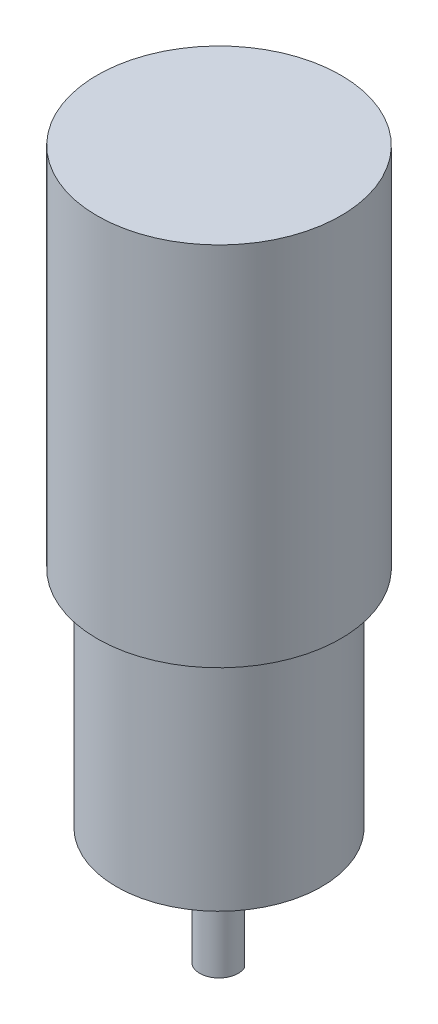
ISO-10303-21;
HEADER;
FILE_DESCRIPTION(('STEP AP214'),'2;1');
FILE_NAME('part.step','',(''),(''),'','','');
FILE_SCHEMA(('AUTOMOTIVE_DESIGN { 1 0 10303 214 1 1 1 1 }'));
ENDSEC;
DATA;
#1=APPLICATION_CONTEXT('core data for automotive mechanical design processes');
#2=APPLICATION_PROTOCOL_DEFINITION('international standard','automotive_design',2000,#1);
#3=PRODUCT_CONTEXT('',#1,'mechanical');
#4=PRODUCT('Part','Part','',(#3));
#5=PRODUCT_RELATED_PRODUCT_CATEGORY('part','',(#4));
#6=PRODUCT_DEFINITION_FORMATION('','',#4);
#7=PRODUCT_DEFINITION_CONTEXT('part definition',#1,'design');
#8=PRODUCT_DEFINITION('design','',#6,#7);
#9=PRODUCT_DEFINITION_SHAPE('','',#8);
#10=(LENGTH_UNIT() NAMED_UNIT(*) SI_UNIT(.MILLI.,.METRE.));
#11=(NAMED_UNIT(*) PLANE_ANGLE_UNIT() SI_UNIT($,.RADIAN.));
#12=(NAMED_UNIT(*) SI_UNIT($,.STERADIAN.) SOLID_ANGLE_UNIT());
#13=UNCERTAINTY_MEASURE_WITH_UNIT(LENGTH_MEASURE(1.E-05),#10,'distance_accuracy_value','');
#14=(GEOMETRIC_REPRESENTATION_CONTEXT(3) GLOBAL_UNCERTAINTY_ASSIGNED_CONTEXT((#13)) GLOBAL_UNIT_ASSIGNED_CONTEXT((#10,
#11,#12)) REPRESENTATION_CONTEXT('',''));
#15=CARTESIAN_POINT('',(0.,0.,0.));
#16=DIRECTION('',(0.,0.,1.));
#17=DIRECTION('',(1.,0.,0.));
#18=AXIS2_PLACEMENT_3D('',#15,#16,#17);
#19=CARTESIAN_POINT('',(0.,12.,-1.19895788082818));
#20=DIRECTION('',(0.,0.,-1.));
#21=DIRECTION('',(-1.,0.,0.));
#22=AXIS2_PLACEMENT_3D('',#19,#20,#21);
#23=PLANE('',#22);
#24=DIRECTION('',(1.,0.,0.));
#25=VECTOR('',#24,1.);
#26=CARTESIAN_POINT('',(0.,0.,-1.19895788082818));
#27=LINE('',#26,#25);
#28=CARTESIAN_POINT('',(-2.75,0.,-1.19895788082818));
#29=VERTEX_POINT('',#28);
#30=CARTESIAN_POINT('',(2.75,0.,-1.19895788082818));
#31=VERTEX_POINT('',#30);
#32=EDGE_CURVE('E141',#29,#31,#27,.T.);
#33=ORIENTED_EDGE('',*,*,#32,.F.);
#34=DIRECTION('',(0.,-1.,0.));
#35=VECTOR('',#34,1.);
#36=CARTESIAN_POINT('',(-2.75,12.,-1.19895788082818));
#37=LINE('',#36,#35);
#38=CARTESIAN_POINT('',(-2.75,12.,-1.19895788082818));
#39=VERTEX_POINT('',#38);
#40=EDGE_CURVE('E11',#39,#29,#37,.T.);
#41=ORIENTED_EDGE('',*,*,#40,.F.);
#42=DIRECTION('',(1.,0.,0.));
#43=VECTOR('',#42,1.);
#44=CARTESIAN_POINT('',(0.,12.,-1.19895788082818));
#45=LINE('',#44,#43);
#46=CARTESIAN_POINT('',(2.75,12.,-1.19895788082818));
#47=VERTEX_POINT('',#46);
#48=EDGE_CURVE('E66',#39,#47,#45,.T.);
#49=ORIENTED_EDGE('',*,*,#48,.T.);
#50=DIRECTION('',(0.,-1.,0.));
#51=VECTOR('',#50,1.);
#52=CARTESIAN_POINT('',(2.75,12.,-1.19895788082818));
#53=LINE('',#52,#51);
#54=EDGE_CURVE('E47',#47,#31,#53,.T.);
#55=ORIENTED_EDGE('',*,*,#54,.T.);
#56=EDGE_LOOP('',(#33,#41,#49,#55));
#57=FACE_BOUND('',#56,.T.);
#58=ADVANCED_FACE('F39',(#57),#23,.T.);
#59=CARTESIAN_POINT('',(0.,12.,0.));
#60=DIRECTION('',(0.,-1.,0.));
#61=DIRECTION('',(0.,0.,-1.));
#62=AXIS2_PLACEMENT_3D('',#59,#60,#61);
#63=CYLINDRICAL_SURFACE('',#62,3.);
#64=CARTESIAN_POINT('',(0.,0.,0.));
#65=DIRECTION('',(0.,1.,0.));
#66=DIRECTION('',(0.,0.,1.));
#67=AXIS2_PLACEMENT_3D('',#64,#65,#66);
#68=CIRCLE('',#67,3.);
#69=EDGE_CURVE('E144',#29,#31,#68,.T.);
#70=ORIENTED_EDGE('',*,*,#69,.T.);
#71=ORIENTED_EDGE('',*,*,#54,.F.);
#72=CARTESIAN_POINT('',(0.,12.,0.));
#73=DIRECTION('',(0.,1.,0.));
#74=DIRECTION('',(0.,0.,1.));
#75=AXIS2_PLACEMENT_3D('',#72,#73,#74);
#76=CIRCLE('',#75,3.);
#77=EDGE_CURVE('E53',#47,#39,#76,.T.);
#78=ORIENTED_EDGE('',*,*,#77,.T.);
#79=ORIENTED_EDGE('',*,*,#40,.T.);
#80=EDGE_LOOP('',(#70,#71,#78,#79));
#81=FACE_BOUND('',#80,.T.);
#82=CARTESIAN_POINT('',(0.,15.2,0.));
#83=DIRECTION('',(0.,1.,0.));
#84=DIRECTION('',(0.,0.,1.));
#85=AXIS2_PLACEMENT_3D('',#82,#83,#84);
#86=CIRCLE('',#85,3.);
#87=CARTESIAN_POINT('',(0.,15.2,3.));
#88=VERTEX_POINT('',#87);
#89=EDGE_CURVE('E138',#88,#88,#86,.T.);
#90=ORIENTED_EDGE('',*,*,#89,.F.);
#91=EDGE_LOOP('',(#90));
#92=FACE_BOUND('',#91,.T.);
#93=ADVANCED_FACE('F149',(#81,#92),#63,.T.);
#94=CARTESIAN_POINT('',(0.,0.,0.));
#95=DIRECTION('',(0.,1.,0.));
#96=DIRECTION('',(0.,0.,1.));
#97=AXIS2_PLACEMENT_3D('',#94,#95,#96);
#98=PLANE('',#97);
#99=ORIENTED_EDGE('',*,*,#32,.T.);
#100=ORIENTED_EDGE('',*,*,#69,.F.);
#101=EDGE_LOOP('',(#99,#100));
#102=FACE_BOUND('',#101,.T.);
#103=ADVANCED_FACE('F152',(#102),#98,.F.);
#104=CARTESIAN_POINT('',(0.,12.,0.));
#105=DIRECTION('',(0.,1.,0.));
#106=DIRECTION('',(0.,0.,1.));
#107=AXIS2_PLACEMENT_3D('',#104,#105,#106);
#108=PLANE('',#107);
#109=ORIENTED_EDGE('',*,*,#48,.F.);
#110=ORIENTED_EDGE('',*,*,#77,.F.);
#111=EDGE_LOOP('',(#109,#110));
#112=FACE_BOUND('',#111,.T.);
#113=ADVANCED_FACE('F154',(#112),#108,.F.);
#114=CARTESIAN_POINT('',(0.,18.2,0.));
#115=DIRECTION('',(0.,-1.,0.));
#116=DIRECTION('',(0.,0.,-1.));
#117=AXIS2_PLACEMENT_3D('',#114,#115,#116);
#118=CYLINDRICAL_SURFACE('',#117,10.);
#119=CARTESIAN_POINT('',(0.,15.2,0.));
#120=DIRECTION('',(0.,1.,0.));
#121=DIRECTION('',(0.,0.,1.));
#122=AXIS2_PLACEMENT_3D('',#119,#120,#121);
#123=CIRCLE('',#122,10.);
#124=CARTESIAN_POINT('',(9.,15.2,-4.35889894354067));
#125=VERTEX_POINT('',#124);
#126=CARTESIAN_POINT('',(-9.,15.2,-4.35889894354068));
#127=VERTEX_POINT('',#126);
#128=EDGE_CURVE('E125',#125,#127,#123,.T.);
#129=ORIENTED_EDGE('',*,*,#128,.T.);
#130=DIRECTION('',(0.,-1.,0.));
#131=VECTOR('',#130,1.);
#132=CARTESIAN_POINT('',(-9.,18.2,-4.35889894354068));
#133=LINE('',#132,#131);
#134=CARTESIAN_POINT('',(-9.,18.2,-4.35889894354068));
#135=VERTEX_POINT('',#134);
#136=EDGE_CURVE('E111',#135,#127,#133,.T.);
#137=ORIENTED_EDGE('',*,*,#136,.F.);
#138=CARTESIAN_POINT('',(0.,18.2,0.));
#139=DIRECTION('',(0.,1.,0.));
#140=DIRECTION('',(0.,0.,1.));
#141=AXIS2_PLACEMENT_3D('',#138,#139,#140);
#142=CIRCLE('',#141,10.);
#143=CARTESIAN_POINT('',(9.,18.2,-4.35889894354067));
#144=VERTEX_POINT('',#143);
#145=EDGE_CURVE('E106',#144,#135,#142,.T.);
#146=ORIENTED_EDGE('',*,*,#145,.F.);
#147=DIRECTION('',(0.,-1.,0.));
#148=VECTOR('',#147,1.);
#149=CARTESIAN_POINT('',(9.,18.2,-4.35889894354067));
#150=LINE('',#149,#148);
#151=EDGE_CURVE('E109',#144,#125,#150,.T.);
#152=ORIENTED_EDGE('',*,*,#151,.T.);
#153=EDGE_LOOP('',(#129,#137,#146,#152));
#154=FACE_BOUND('',#153,.T.);
#155=ADVANCED_FACE('F108',(#154),#118,.T.);
#156=CARTESIAN_POINT('',(-9.,18.2,-4.35889894354068));
#157=DIRECTION('',(1.,0.,0.));
#158=DIRECTION('',(0.,0.,-1.));
#159=AXIS2_PLACEMENT_3D('',#156,#157,#158);
#160=PLANE('',#159);
#161=DIRECTION('',(0.,0.,1.));
#162=VECTOR('',#161,1.);
#163=CARTESIAN_POINT('',(-9.,15.2,-4.35889894354068));
#164=LINE('',#163,#162);
#165=CARTESIAN_POINT('',(-9.,15.2,4.35889894354068));
#166=VERTEX_POINT('',#165);
#167=EDGE_CURVE('E127',#127,#166,#164,.T.);
#168=ORIENTED_EDGE('',*,*,#167,.T.);
#169=DIRECTION('',(0.,-1.,0.));
#170=VECTOR('',#169,1.);
#171=CARTESIAN_POINT('',(-9.,18.2,4.35889894354068));
#172=LINE('',#171,#170);
#173=CARTESIAN_POINT('',(-9.,18.2,4.35889894354068));
#174=VERTEX_POINT('',#173);
#175=EDGE_CURVE('E134',#174,#166,#172,.T.);
#176=ORIENTED_EDGE('',*,*,#175,.F.);
#177=DIRECTION('',(0.,0.,1.));
#178=VECTOR('',#177,1.);
#179=CARTESIAN_POINT('',(-9.,18.2,-4.35889894354068));
#180=LINE('',#179,#178);
#181=EDGE_CURVE('E100',#135,#174,#180,.T.);
#182=ORIENTED_EDGE('',*,*,#181,.F.);
#183=ORIENTED_EDGE('',*,*,#136,.T.);
#184=EDGE_LOOP('',(#168,#176,#182,#183));
#185=FACE_BOUND('',#184,.T.);
#186=ADVANCED_FACE('F193',(#185),#160,.F.);
#187=CARTESIAN_POINT('',(0.,18.2,0.));
#188=DIRECTION('',(0.,-1.,0.));
#189=DIRECTION('',(0.,0.,-1.));
#190=AXIS2_PLACEMENT_3D('',#187,#188,#189);
#191=CYLINDRICAL_SURFACE('',#190,10.);
#192=CARTESIAN_POINT('',(0.,15.2,0.));
#193=DIRECTION('',(0.,1.,0.));
#194=DIRECTION('',(0.,0.,1.));
#195=AXIS2_PLACEMENT_3D('',#192,#193,#194);
#196=CIRCLE('',#195,10.);
#197=CARTESIAN_POINT('',(9.,15.2,4.35889894354068));
#198=VERTEX_POINT('',#197);
#199=EDGE_CURVE('E130',#166,#198,#196,.T.);
#200=ORIENTED_EDGE('',*,*,#199,.T.);
#201=DIRECTION('',(0.,-1.,0.));
#202=VECTOR('',#201,1.);
#203=CARTESIAN_POINT('',(9.,18.2,4.35889894354068));
#204=LINE('',#203,#202);
#205=CARTESIAN_POINT('',(9.,18.2,4.35889894354068));
#206=VERTEX_POINT('',#205);
#207=EDGE_CURVE('E74',#206,#198,#204,.T.);
#208=ORIENTED_EDGE('',*,*,#207,.F.);
#209=CARTESIAN_POINT('',(0.,18.2,0.));
#210=DIRECTION('',(0.,1.,0.));
#211=DIRECTION('',(0.,0.,1.));
#212=AXIS2_PLACEMENT_3D('',#209,#210,#211);
#213=CIRCLE('',#212,10.);
#214=EDGE_CURVE('E120',#174,#206,#213,.T.);
#215=ORIENTED_EDGE('',*,*,#214,.F.);
#216=ORIENTED_EDGE('',*,*,#175,.T.);
#217=EDGE_LOOP('',(#200,#208,#215,#216));
#218=FACE_BOUND('',#217,.T.);
#219=ADVANCED_FACE('F201',(#218),#191,.T.);
#220=CARTESIAN_POINT('',(9.,18.2,-4.35889894354067));
#221=DIRECTION('',(-1.,0.,0.));
#222=DIRECTION('',(0.,0.,1.));
#223=AXIS2_PLACEMENT_3D('',#220,#221,#222);
#224=PLANE('',#223);
#225=DIRECTION('',(0.,0.,-1.));
#226=VECTOR('',#225,1.);
#227=CARTESIAN_POINT('',(9.,15.2,-4.35889894354067));
#228=LINE('',#227,#226);
#229=EDGE_CURVE('E94',#198,#125,#228,.T.);
#230=ORIENTED_EDGE('',*,*,#229,.T.);
#231=ORIENTED_EDGE('',*,*,#151,.F.);
#232=DIRECTION('',(0.,0.,-1.));
#233=VECTOR('',#232,1.);
#234=CARTESIAN_POINT('',(9.,18.2,-4.35889894354067));
#235=LINE('',#234,#233);
#236=EDGE_CURVE('E116',#206,#144,#235,.T.);
#237=ORIENTED_EDGE('',*,*,#236,.F.);
#238=ORIENTED_EDGE('',*,*,#207,.T.);
#239=EDGE_LOOP('',(#230,#231,#237,#238));
#240=FACE_BOUND('',#239,.T.);
#241=ADVANCED_FACE('F115',(#240),#224,.F.);
#242=CARTESIAN_POINT('',(0.,15.2,0.));
#243=DIRECTION('',(0.,1.,0.));
#244=DIRECTION('',(0.,0.,1.));
#245=AXIS2_PLACEMENT_3D('',#242,#243,#244);
#246=PLANE('',#245);
#247=ORIENTED_EDGE('',*,*,#89,.T.);
#248=EDGE_LOOP('',(#247));
#249=FACE_BOUND('',#248,.T.);
#250=ORIENTED_EDGE('',*,*,#128,.F.);
#251=ORIENTED_EDGE('',*,*,#229,.F.);
#252=ORIENTED_EDGE('',*,*,#199,.F.);
#253=ORIENTED_EDGE('',*,*,#167,.F.);
#254=EDGE_LOOP('',(#250,#251,#252,#253));
#255=FACE_BOUND('',#254,.T.);
#256=ADVANCED_FACE('F180',(#249,#255),#246,.F.);
#257=CARTESIAN_POINT('',(0.,18.2,0.));
#258=DIRECTION('',(0.,1.,0.));
#259=DIRECTION('',(0.,0.,1.));
#260=AXIS2_PLACEMENT_3D('',#257,#258,#259);
#261=PLANE('',#260);
#262=CARTESIAN_POINT('',(0.,18.2,0.));
#263=DIRECTION('',(0.,1.,0.));
#264=DIRECTION('',(0.,0.,1.));
#265=AXIS2_PLACEMENT_3D('',#262,#263,#264);
#266=CIRCLE('',#265,16.);
#267=CARTESIAN_POINT('',(0.,18.2,16.));
#268=VERTEX_POINT('',#267);
#269=EDGE_CURVE('E299',#268,#268,#266,.T.);
#270=ORIENTED_EDGE('',*,*,#269,.F.);
#271=EDGE_LOOP('',(#270));
#272=FACE_BOUND('',#271,.T.);
#273=ORIENTED_EDGE('',*,*,#236,.T.);
#274=ORIENTED_EDGE('',*,*,#145,.T.);
#275=ORIENTED_EDGE('',*,*,#181,.T.);
#276=ORIENTED_EDGE('',*,*,#214,.T.);
#277=EDGE_LOOP('',(#273,#274,#275,#276));
#278=FACE_BOUND('',#277,.T.);
#279=ADVANCED_FACE('F119',(#272,#278),#261,.F.);
#280=CARTESIAN_POINT('',(0.,53.2,0.));
#281=DIRECTION('',(0.,-1.,0.));
#282=DIRECTION('',(0.,0.,-1.));
#283=AXIS2_PLACEMENT_3D('',#280,#281,#282);
#284=CYLINDRICAL_SURFACE('',#283,16.);
#285=CARTESIAN_POINT('',(0.,53.2,0.));
#286=DIRECTION('',(0.,1.,0.));
#287=DIRECTION('',(0.,0.,1.));
#288=AXIS2_PLACEMENT_3D('',#285,#286,#287);
#289=CIRCLE('',#288,16.);
#290=CARTESIAN_POINT('',(0.,53.2,16.));
#291=VERTEX_POINT('',#290);
#292=EDGE_CURVE('E128',#291,#291,#289,.T.);
#293=ORIENTED_EDGE('',*,*,#292,.F.);
#294=EDGE_LOOP('',(#293));
#295=FACE_BOUND('',#294,.T.);
#296=ORIENTED_EDGE('',*,*,#269,.T.);
#297=EDGE_LOOP('',(#296));
#298=FACE_BOUND('',#297,.T.);
#299=ADVANCED_FACE('F221',(#295,#298),#284,.T.);
#300=CARTESIAN_POINT('',(0.,110.3,0.));
#301=DIRECTION('',(0.,-1.,0.));
#302=DIRECTION('',(0.,0.,-1.));
#303=AXIS2_PLACEMENT_3D('',#300,#301,#302);
#304=CYLINDRICAL_SURFACE('',#303,19.);
#305=CARTESIAN_POINT('',(0.,110.3,0.));
#306=DIRECTION('',(0.,1.,0.));
#307=DIRECTION('',(0.,0.,1.));
#308=AXIS2_PLACEMENT_3D('',#305,#306,#307);
#309=CIRCLE('',#308,19.);
#310=CARTESIAN_POINT('',(0.,110.3,19.));
#311=VERTEX_POINT('',#310);
#312=EDGE_CURVE('E296',#311,#311,#309,.T.);
#313=ORIENTED_EDGE('',*,*,#312,.F.);
#314=EDGE_LOOP('',(#313));
#315=FACE_BOUND('',#314,.T.);
#316=CARTESIAN_POINT('',(0.,53.2,0.));
#317=DIRECTION('',(0.,1.,0.));
#318=DIRECTION('',(0.,0.,1.));
#319=AXIS2_PLACEMENT_3D('',#316,#317,#318);
#320=CIRCLE('',#319,19.);
#321=CARTESIAN_POINT('',(0.,53.2,19.));
#322=VERTEX_POINT('',#321);
#323=EDGE_CURVE('E294',#322,#322,#320,.T.);
#324=ORIENTED_EDGE('',*,*,#323,.T.);
#325=EDGE_LOOP('',(#324));
#326=FACE_BOUND('',#325,.T.);
#327=ADVANCED_FACE('F230',(#315,#326),#304,.T.);
#328=CARTESIAN_POINT('',(0.,110.3,0.));
#329=DIRECTION('',(0.,1.,0.));
#330=DIRECTION('',(0.,0.,1.));
#331=AXIS2_PLACEMENT_3D('',#328,#329,#330);
#332=PLANE('',#331);
#333=ORIENTED_EDGE('',*,*,#312,.T.);
#334=EDGE_LOOP('',(#333));
#335=FACE_BOUND('',#334,.T.);
#336=ADVANCED_FACE('F239',(#335),#332,.T.);
#337=CARTESIAN_POINT('',(0.,53.2,0.));
#338=DIRECTION('',(0.,1.,0.));
#339=DIRECTION('',(0.,0.,1.));
#340=AXIS2_PLACEMENT_3D('',#337,#338,#339);
#341=PLANE('',#340);
#342=ORIENTED_EDGE('',*,*,#292,.T.);
#343=EDGE_LOOP('',(#342));
#344=FACE_BOUND('',#343,.T.);
#345=ORIENTED_EDGE('',*,*,#323,.F.);
#346=EDGE_LOOP('',(#345));
#347=FACE_BOUND('',#346,.T.);
#348=ADVANCED_FACE('F248',(#344,#347),#341,.F.);
#349=CLOSED_SHELL('',(#58,#93,#103,#113,#155,#186,#219,#241,#256,#279,#299,#327,#336,#348));
#350=MANIFOLD_SOLID_BREP('B2',#349);
#351=ADVANCED_BREP_SHAPE_REPRESENTATION('',(#18,#350),#14);
#352=SHAPE_DEFINITION_REPRESENTATION(#9,#351);
ENDSEC;
END-ISO-10303-21;
